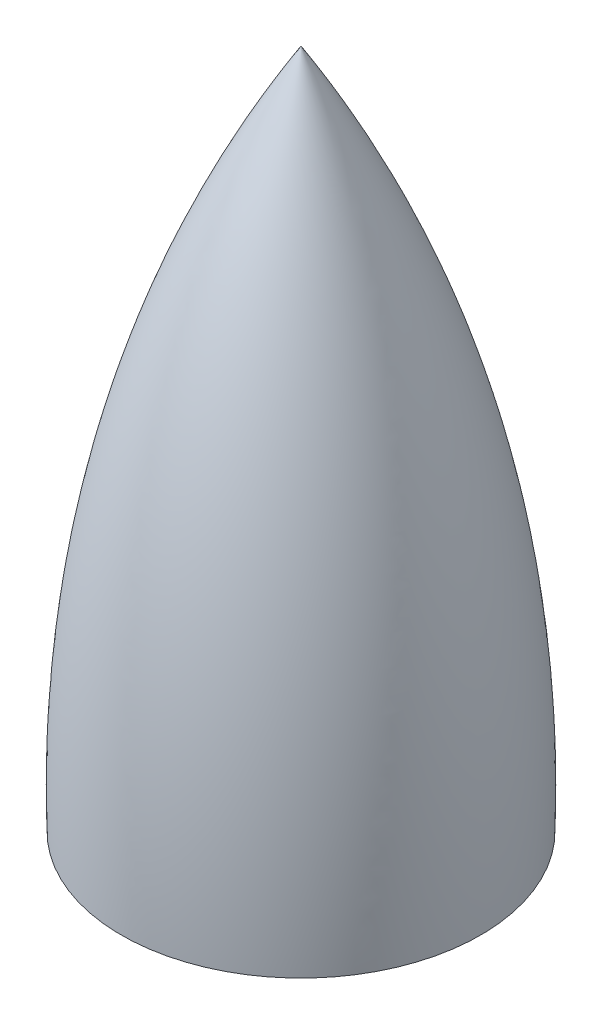
ISO-10303-21;
HEADER;
FILE_DESCRIPTION(('STEP AP214'),'2;1');
FILE_NAME('part.step','',(''),(''),'','','');
FILE_SCHEMA(('AUTOMOTIVE_DESIGN { 1 0 10303 214 1 1 1 1 }'));
ENDSEC;
DATA;
#1=APPLICATION_CONTEXT('core data for automotive mechanical design processes');
#2=APPLICATION_PROTOCOL_DEFINITION('international standard','automotive_design',2000,#1);
#3=PRODUCT_CONTEXT('',#1,'mechanical');
#4=PRODUCT('Part','Part','',(#3));
#5=PRODUCT_RELATED_PRODUCT_CATEGORY('part','',(#4));
#6=PRODUCT_DEFINITION_FORMATION('','',#4);
#7=PRODUCT_DEFINITION_CONTEXT('part definition',#1,'design');
#8=PRODUCT_DEFINITION('design','',#6,#7);
#9=PRODUCT_DEFINITION_SHAPE('','',#8);
#10=(LENGTH_UNIT() NAMED_UNIT(*) SI_UNIT(.MILLI.,.METRE.));
#11=(NAMED_UNIT(*) PLANE_ANGLE_UNIT() SI_UNIT($,.RADIAN.));
#12=(NAMED_UNIT(*) SI_UNIT($,.STERADIAN.) SOLID_ANGLE_UNIT());
#13=UNCERTAINTY_MEASURE_WITH_UNIT(LENGTH_MEASURE(1.E-05),#10,'distance_accuracy_value','');
#14=(GEOMETRIC_REPRESENTATION_CONTEXT(3) GLOBAL_UNCERTAINTY_ASSIGNED_CONTEXT((#13)) GLOBAL_UNIT_ASSIGNED_CONTEXT((#10,
#11,#12)) REPRESENTATION_CONTEXT('',''));
#15=CARTESIAN_POINT('',(0.,0.,0.));
#16=DIRECTION('',(0.,0.,1.));
#17=DIRECTION('',(1.,0.,0.));
#18=AXIS2_PLACEMENT_3D('',#15,#16,#17);
#19=CARTESIAN_POINT('',(-101.6,0.,0.));
#20=CARTESIAN_POINT('',(-107.046011686448,212.987606475833,0.));
#21=CARTESIAN_POINT('',(0.,393.686364613473,0.));
#22=B_SPLINE_CURVE_WITH_KNOTS('',2,(#19,#20,#21),.UNSPECIFIED.,.F.,.F.,(3,3),(0.,1.),.UNSPECIFIED.);
#23=CARTESIAN_POINT('',(0.,0.,0.));
#24=DIRECTION('',(0.,-1.,0.));
#25=AXIS1_PLACEMENT('',#23,#24);
#26=SURFACE_OF_REVOLUTION('',#22,#25);
#27=CARTESIAN_POINT('',(0.,393.686364613473,0.));
#28=VERTEX_POINT('',#27);
#29=VERTEX_LOOP('',#28);
#30=FACE_BOUND('',#29,.T.);
#31=CARTESIAN_POINT('',(0.,0.,0.));
#32=DIRECTION('',(0.,-1.,0.));
#33=DIRECTION('',(0.,0.,-1.));
#34=AXIS2_PLACEMENT_3D('',#31,#32,#33);
#35=CIRCLE('',#34,101.6);
#36=CARTESIAN_POINT('',(0.,0.,-101.6));
#37=VERTEX_POINT('',#36);
#38=EDGE_CURVE('E41',#37,#37,#35,.T.);
#39=ORIENTED_EDGE('',*,*,#38,.T.);
#40=EDGE_LOOP('',(#39));
#41=FACE_BOUND('',#40,.T.);
#42=ADVANCED_FACE('F33',(#30,#41),#26,.T.);
#43=CARTESIAN_POINT('',(-104.775,0.,0.));
#44=CARTESIAN_POINT('',(-110.968397663019,215.541081292785,0.));
#45=CARTESIAN_POINT('',(0.,396.861364613473,0.));
#46=B_SPLINE_CURVE_WITH_KNOTS('',2,(#43,#44,#45),.UNSPECIFIED.,.F.,.F.,(3,3),(0.,1.),.UNSPECIFIED.);
#47=CARTESIAN_POINT('',(0.,0.,0.));
#48=DIRECTION('',(0.,-1.,0.));
#49=AXIS1_PLACEMENT('',#47,#48);
#50=SURFACE_OF_REVOLUTION('',#46,#49);
#51=CARTESIAN_POINT('',(0.,396.861364613473,0.));
#52=VERTEX_POINT('',#51);
#53=VERTEX_LOOP('',#52);
#54=FACE_BOUND('',#53,.T.);
#55=CARTESIAN_POINT('',(0.,0.,0.));
#56=DIRECTION('',(0.,-1.,0.));
#57=DIRECTION('',(0.,0.,-1.));
#58=AXIS2_PLACEMENT_3D('',#55,#56,#57);
#59=CIRCLE('',#58,104.775);
#60=CARTESIAN_POINT('',(0.,0.,-104.775));
#61=VERTEX_POINT('',#60);
#62=EDGE_CURVE('E11',#61,#61,#59,.T.);
#63=ORIENTED_EDGE('',*,*,#62,.F.);
#64=EDGE_LOOP('',(#63));
#65=FACE_BOUND('',#64,.T.);
#66=ADVANCED_FACE('F49',(#54,#65),#50,.F.);
#67=CARTESIAN_POINT('',(-101.6,0.,0.));
#68=DIRECTION('',(0.,-1.,0.));
#69=DIRECTION('',(0.,0.,-1.));
#70=AXIS2_PLACEMENT_3D('',#67,#68,#69);
#71=PLANE('',#70);
#72=ORIENTED_EDGE('',*,*,#62,.T.);
#73=EDGE_LOOP('',(#72));
#74=FACE_BOUND('',#73,.T.);
#75=ORIENTED_EDGE('',*,*,#38,.F.);
#76=EDGE_LOOP('',(#75));
#77=FACE_BOUND('',#76,.T.);
#78=ADVANCED_FACE('F65',(#74,#77),#71,.T.);
#79=CLOSED_SHELL('',(#42,#66,#78));
#80=MANIFOLD_SOLID_BREP('B2',#79);
#81=ADVANCED_BREP_SHAPE_REPRESENTATION('',(#18,#80),#14);
#82=SHAPE_DEFINITION_REPRESENTATION(#9,#81);
ENDSEC;
END-ISO-10303-21;
